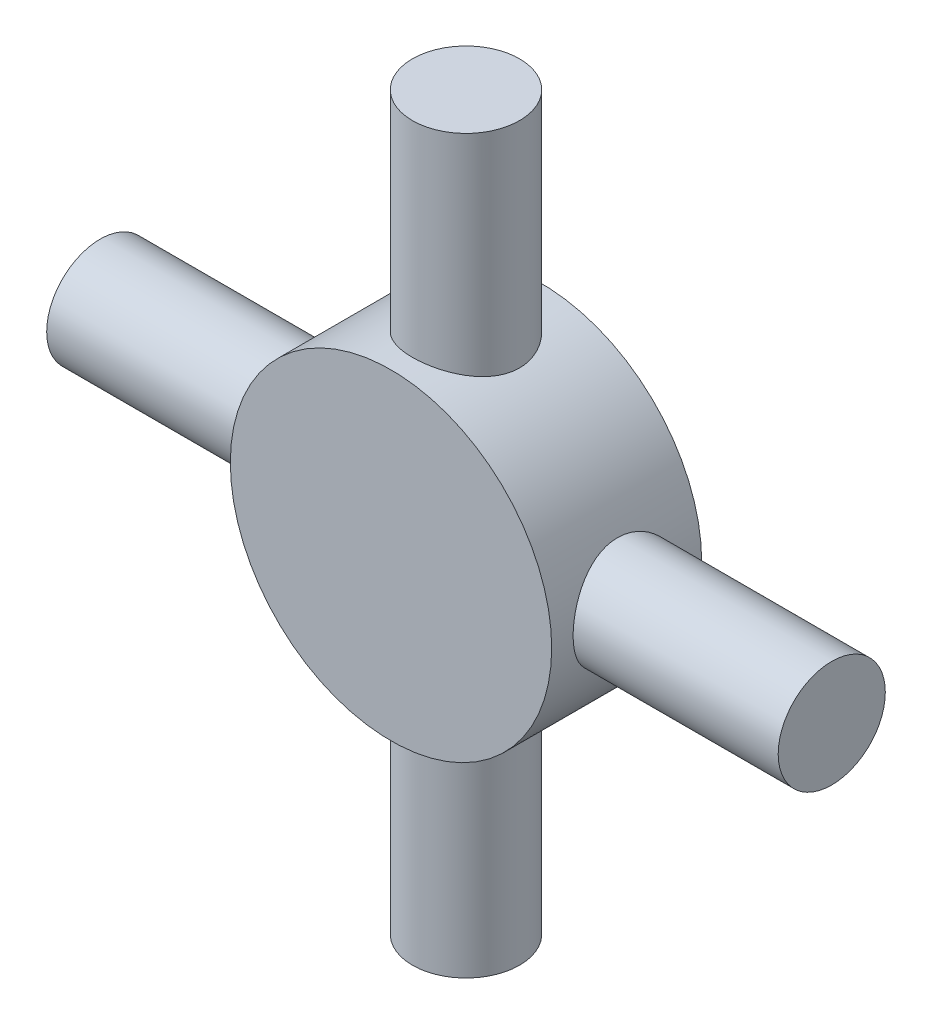
ISO-10303-21;
HEADER;
FILE_DESCRIPTION(('STEP AP214'),'2;1');
FILE_NAME('part.step','',(''),(''),'','','');
FILE_SCHEMA(('AUTOMOTIVE_DESIGN { 1 0 10303 214 1 1 1 1 }'));
ENDSEC;
DATA;
#1=APPLICATION_CONTEXT('core data for automotive mechanical design processes');
#2=APPLICATION_PROTOCOL_DEFINITION('international standard','automotive_design',2000,#1);
#3=PRODUCT_CONTEXT('',#1,'mechanical');
#4=PRODUCT('Part','Part','',(#3));
#5=PRODUCT_RELATED_PRODUCT_CATEGORY('part','',(#4));
#6=PRODUCT_DEFINITION_FORMATION('','',#4);
#7=PRODUCT_DEFINITION_CONTEXT('part definition',#1,'design');
#8=PRODUCT_DEFINITION('design','',#6,#7);
#9=PRODUCT_DEFINITION_SHAPE('','',#8);
#10=(LENGTH_UNIT() NAMED_UNIT(*) SI_UNIT(.MILLI.,.METRE.));
#11=(NAMED_UNIT(*) PLANE_ANGLE_UNIT() SI_UNIT($,.RADIAN.));
#12=(NAMED_UNIT(*) SI_UNIT($,.STERADIAN.) SOLID_ANGLE_UNIT());
#13=UNCERTAINTY_MEASURE_WITH_UNIT(LENGTH_MEASURE(1.E-05),#10,'distance_accuracy_value','');
#14=(GEOMETRIC_REPRESENTATION_CONTEXT(3) GLOBAL_UNCERTAINTY_ASSIGNED_CONTEXT((#13)) GLOBAL_UNIT_ASSIGNED_CONTEXT((#10,
#11,#12)) REPRESENTATION_CONTEXT('',''));
#15=CARTESIAN_POINT('',(0.,0.,0.));
#16=DIRECTION('',(0.,0.,1.));
#17=DIRECTION('',(1.,0.,0.));
#18=AXIS2_PLACEMENT_3D('',#15,#16,#17);
#19=CARTESIAN_POINT('',(0.,0.,5.));
#20=DIRECTION('',(0.,0.,-1.));
#21=DIRECTION('',(-1.,0.,0.));
#22=AXIS2_PLACEMENT_3D('',#19,#20,#21);
#23=CYLINDRICAL_SURFACE('',#22,7.5);
#24=CARTESIAN_POINT('',(7.5,0.,0.));
#25=CARTESIAN_POINT('',(7.5000003825236,0.136408407216808,-6.34329101924872E-07));
#26=CARTESIAN_POINT('',(7.49624423768862,0.272812986346375,0.0112006653180414));
#27=CARTESIAN_POINT('',(7.48163025508202,0.54160440218243,0.0555727720430464));
#28=CARTESIAN_POINT('',(7.47077168005381,0.673990820297044,0.0887458598723056));
#29=CARTESIAN_POINT('',(7.44313269766107,0.93083197375444,0.175798108460121));
#30=CARTESIAN_POINT('',(7.42636219327133,1.05529956471509,0.229642656148179));
#31=CARTESIAN_POINT('',(7.38861114293355,1.29343734201331,0.356352932095868));
#32=CARTESIAN_POINT('',(7.36762976669445,1.40710539239676,0.429222412506503));
#33=CARTESIAN_POINT('',(7.32285236107513,1.62435418755567,0.594564512146881));
#34=CARTESIAN_POINT('',(7.29898891159462,1.72750925074577,0.687578085651233));
#35=CARTESIAN_POINT('',(7.25150786957804,1.91708173175521,0.889417886766415));
#36=CARTESIAN_POINT('',(7.22789033226373,2.00349546372366,0.998247587321281));
#37=CARTESIAN_POINT('',(7.18283331193184,2.15956235556965,1.23246278799115));
#38=CARTESIAN_POINT('',(7.1614759818922,2.22866214555258,1.35823434933031));
#39=CARTESIAN_POINT('',(7.12438263546503,2.3445471846943,1.62044023614637));
#40=CARTESIAN_POINT('',(7.10864490401864,2.39133924346691,1.75687129290686));
#41=CARTESIAN_POINT('',(7.08528258173443,2.45968365377291,2.03168305374178));
#42=CARTESIAN_POINT('',(7.07740239424028,2.48203362067942,2.16984302122266));
#43=CARTESIAN_POINT('',(7.06989141573769,2.50335280833619,2.4481593853897));
#44=CARTESIAN_POINT('',(7.07025807556825,2.5023292540118,2.58831515177298));
#45=CARTESIAN_POINT('',(7.0789753752045,2.47754975925855,2.85984157611005));
#46=CARTESIAN_POINT('',(7.08696039668832,2.45483478291749,2.99132100729755));
#47=CARTESIAN_POINT('',(7.10941644311377,2.38901540712354,3.24848354901709));
#48=CARTESIAN_POINT('',(7.12388824460269,2.34590856647968,3.37416596358768));
#49=CARTESIAN_POINT('',(7.15794777828122,2.23984764515053,3.6185318739787));
#50=CARTESIAN_POINT('',(7.17761414482793,2.17658512176816,3.73707006367381));
#51=CARTESIAN_POINT('',(7.21981396439316,2.03222276575785,3.96217727069932));
#52=CARTESIAN_POINT('',(7.24234824476159,1.95111778091001,4.06874281733345));
#53=CARTESIAN_POINT('',(7.28918322919352,1.76837333170559,4.27272899540193));
#54=CARTESIAN_POINT('',(7.31351473387107,1.66588287519078,4.36938173627267));
#55=CARTESIAN_POINT('',(7.36017345967592,1.44584892492516,4.54432816665849));
#56=CARTESIAN_POINT('',(7.38250048845169,1.32830398915204,4.62262009541124));
#57=CARTESIAN_POINT('',(7.42292769844484,1.07986903261567,4.75924075058767));
#58=CARTESIAN_POINT('',(7.44098375020098,0.948858191040842,4.81736372835183));
#59=CARTESIAN_POINT('',(7.47051417861087,0.678172708411269,4.91050793488928));
#60=CARTESIAN_POINT('',(7.48199084137198,0.538501095387384,4.94553718855859));
#61=CARTESIAN_POINT('',(7.49669067678601,0.260959573823261,4.9901391650559));
#62=CARTESIAN_POINT('',(7.5002500458432,0.123273999662116,5.00074952293188));
#63=CARTESIAN_POINT('',(7.49972256737069,-0.151937674900592,4.99916831600383));
#64=CARTESIAN_POINT('',(7.49563701048406,-0.289463798299125,4.98698060005031));
#65=CARTESIAN_POINT('',(7.48050061792761,-0.556299665760639,4.9409702306601));
#66=CARTESIAN_POINT('',(7.46965496777981,-0.685732017087108,4.90778448487626));
#67=CARTESIAN_POINT('',(7.44229617075175,-0.937139896448934,4.82151638883318));
#68=CARTESIAN_POINT('',(7.42578230116688,-1.05911447127152,4.76843150133054));
#69=CARTESIAN_POINT('',(7.38822328218224,-1.29572074098318,4.64232392039804));
#70=CARTESIAN_POINT('',(7.36707036889465,-1.41007489804287,4.56881351679207));
#71=CARTESIAN_POINT('',(7.32263134790656,-1.62516207533897,4.40451462496629));
#72=CARTESIAN_POINT('',(7.29934458984569,-1.72589091948894,4.31372085992059));
#73=CARTESIAN_POINT('',(7.25192119951112,-1.91563126951575,4.11255312248353));
#74=CARTESIAN_POINT('',(7.2277940271857,-2.00390242311443,4.00147693268285));
#75=CARTESIAN_POINT('',(7.18249933236772,-2.16064380580894,3.76557108047278));
#76=CARTESIAN_POINT('',(7.16133183455006,-2.22911386982753,3.64074130341481));
#77=CARTESIAN_POINT('',(7.12455979478459,-2.3439923260409,3.38081746177526));
#78=CARTESIAN_POINT('',(7.10894401982447,-2.39044533041255,3.24574480207809));
#79=CARTESIAN_POINT('',(7.08527080766124,-2.45973666689839,2.96905337488967));
#80=CARTESIAN_POINT('',(7.07720996559098,-2.48258563738485,2.82743758648913));
#81=CARTESIAN_POINT('',(7.06994647185443,-2.50319070619336,2.54950725989771));
#82=CARTESIAN_POINT('',(7.07031000643538,-2.502175643271,2.41329414928294));
#83=CARTESIAN_POINT('',(7.07878174559668,-2.47810573362173,2.14308731269485));
#84=CARTESIAN_POINT('',(7.08688948923404,-2.45505219864646,2.00909345511228));
#85=CARTESIAN_POINT('',(7.10961310762229,-2.38842953282336,1.74966084249382));
#86=CARTESIAN_POINT('',(7.12410245056194,-2.34525836503879,1.62410793748876));
#87=CARTESIAN_POINT('',(7.15790997046171,-2.23994841439937,1.38193148265433));
#88=CARTESIAN_POINT('',(7.17722921908483,-2.17780542138451,1.26530992202998));
#89=CARTESIAN_POINT('',(7.21957073065116,-2.03315173145858,1.03879082519272));
#90=CARTESIAN_POINT('',(7.24271779105343,-1.94987060691145,0.929408745254036));
#91=CARTESIAN_POINT('',(7.28958390708132,-1.76660720783912,0.7257754665395));
#92=CARTESIAN_POINT('',(7.31330312280931,-1.66662021112871,0.631528560779813));
#93=CARTESIAN_POINT('',(7.3597507631386,-1.44810389230172,0.457138969277055));
#94=CARTESIAN_POINT('',(7.38240454503142,-1.32900378374932,0.377689130622501));
#95=CARTESIAN_POINT('',(7.4231497793153,-1.07839339351656,0.240023927873383));
#96=CARTESIAN_POINT('',(7.44124239769824,-0.946886295330873,0.181803135194894));
#97=CARTESIAN_POINT('',(7.47013787671355,-0.681234118002441,0.0906959187783202));
#98=CARTESIAN_POINT('',(7.48123031056307,-0.547469394191022,0.056793834341559));
#99=CARTESIAN_POINT('',(7.49616017660555,-0.275801040025618,0.011449298307184));
#100=CARTESIAN_POINT('',(7.49999961329762,-0.137898563921866,6.41258657549568E-07));
#101=CARTESIAN_POINT('',(7.5,0.,0.));
#102=B_SPLINE_CURVE_WITH_KNOTS('',3,(#24,#25,#26,#27,#28,#29,#30,#31,#32,#33,#34,#35,#36,#37,
#38,#39,#40,#41,#42,#43,#44,#45,#46,#47,#48,#49,#50,#51,#52,#53,#54,#55,#56,#57,#58,#59,#60,#61,
#62,#63,#64,#65,#66,#67,#68,#69,#70,#71,#72,#73,#74,#75,#76,#77,#78,#79,#80,#81,#82,#83,#84,#85,
#86,#87,#88,#89,#90,#91,#92,#93,#94,#95,#96,#97,#98,#99,#100,#101),.UNSPECIFIED.,.T.,.F.,(4,2,2,
2,2,2,2,2,2,2,2,2,2,2,2,2,2,2,2,2,2,2,2,2,2,2,2,2,2,2,2,2,2,2,2,2,2,2,4),(0.,0.408717765065027,
0.817477963168802,1.22555668217568,1.63371594449775,2.0546171070689,2.47561083218826,
2.90870962058676,3.34167611732083,3.760048143546,4.17829084968714,4.57742066378201,
4.97659827138705,5.38220427887827,5.78792756395518,6.21483264528417,6.64177864916546,
7.07296014125894,7.50399172193021,7.91633957937924,8.32861782910441,8.72895394945534,
9.1293411321026,9.54025999609341,9.95130452054728,10.3810255720188,10.8107502058749,
11.2396003456693,11.668257117646,12.0748916516065,12.4815019837844,12.8803896770104,
13.2793659543994,13.6957516672951,14.1122552780945,14.5449915208775,14.9776170288114,
15.3909139593453,15.8040966509535),.UNSPECIFIED.);
#103=CARTESIAN_POINT('',(7.5,0.,0.));
#104=VERTEX_POINT('',#103);
#105=EDGE_CURVE('E125',#104,#104,#102,.T.);
#106=ORIENTED_EDGE('',*,*,#105,.F.);
#107=EDGE_LOOP('',(#106));
#108=FACE_BOUND('',#107,.T.);
#109=CARTESIAN_POINT('',(2.49999999999993,-7.0710678118655,2.5));
#110=CARTESIAN_POINT('',(2.50000064486921,-7.07106736326088,2.63617043709018));
#111=CARTESIAN_POINT('',(2.48883695921373,-7.07504423227146,2.77233699955898));
#112=CARTESIAN_POINT('',(2.44462782922195,-7.0904393520314,3.04063605248562));
#113=CARTESIAN_POINT('',(2.41157878042092,-7.10185882855474,3.17276787468117));
#114=CARTESIAN_POINT('',(2.32488871421219,-7.13070509221981,3.42906723249322));
#115=CARTESIAN_POINT('',(2.27128805350804,-7.14812009928307,3.55324982360679));
#116=CARTESIAN_POINT('',(2.14515407110338,-7.18697805025814,3.7909001213699));
#117=CARTESIAN_POINT('',(2.07261657215038,-7.20842188259033,3.90436545638408));
#118=CARTESIAN_POINT('',(1.90762786610712,-7.25386223518685,4.12179990584578));
#119=CARTESIAN_POINT('',(1.81456085344472,-7.27792237111612,4.22528857167932));
#120=CARTESIAN_POINT('',(1.61246916803591,-7.32534662002509,4.4155170030616));
#121=CARTESIAN_POINT('',(1.50344193763086,-7.34871062072406,4.50225407895593));
#122=CARTESIAN_POINT('',(1.26901126991245,-7.39284667304499,4.65869724332398));
#123=CARTESIAN_POINT('',(1.14325477806124,-7.41353519254015,4.72789992654489));
#124=CARTESIAN_POINT('',(0.881078057468607,-7.44923966927458,4.84397896281877));
#125=CARTESIAN_POINT('',(0.744660714217952,-7.46425715507506,4.89086133294226));
#126=CARTESIAN_POINT('',(0.470072043583658,-7.48647688579767,4.95933963658098));
#127=CARTESIAN_POINT('',(0.332126887132343,-7.49393286943898,4.98175861564252));
#128=CARTESIAN_POINT('',(0.0542446870601454,-7.5010902054562,5.00329073340165));
#129=CARTESIAN_POINT('',(-0.0856918338598193,-7.50079355657239,5.00240987913103));
#130=CARTESIAN_POINT('',(-0.357758787984615,-7.49265099046828,4.97788936358493));
#131=CARTESIAN_POINT('',(-0.489980121479219,-7.48510161887793,4.95514367881378));
#132=CARTESIAN_POINT('',(-0.748608597055507,-7.46367418349328,4.88901754754882));
#133=CARTESIAN_POINT('',(-0.875015344448118,-7.44979569077954,4.84563570255044));
#134=CARTESIAN_POINT('',(-1.12038118710501,-7.4168917573306,4.73894670673485));
#135=CARTESIAN_POINT('',(-1.23922055242219,-7.39780106310038,4.67538515363372));
#136=CARTESIAN_POINT('',(-1.46481081381838,-7.35645982597296,4.53035073637836));
#137=CARTESIAN_POINT('',(-1.57155833596343,-7.33420840503665,4.44887289168093));
#138=CARTESIAN_POINT('',(-1.77525216637835,-7.2876547962474,4.26581401635075));
#139=CARTESIAN_POINT('',(-1.87150039266326,-7.26330537922192,4.1634671053963));
#140=CARTESIAN_POINT('',(-2.04569314899551,-7.21618338122249,3.94387818568345));
#141=CARTESIAN_POINT('',(-2.12363485820393,-7.19341104364036,3.82663388567989));
#142=CARTESIAN_POINT('',(-2.25996863758943,-7.15176312802778,3.5783659359914));
#143=CARTESIAN_POINT('',(-2.31806615905343,-7.13294773211867,3.44716967170557));
#144=CARTESIAN_POINT('',(-2.41110798317342,-7.10204127060959,3.17607151446396));
#145=CARTESIAN_POINT('',(-2.44606198936881,-7.08994738717729,3.03617329698439));
#146=CARTESIAN_POINT('',(-2.49040320524388,-7.0744909078896,2.75840411147106));
#147=CARTESIAN_POINT('',(-2.50087273876916,-7.07075900796887,2.62072643812836));
#148=CARTESIAN_POINT('',(-2.49901359727437,-7.07141680147958,2.34555962721473));
#149=CARTESIAN_POINT('',(-2.48668906306698,-7.07580501979534,2.20807045994003));
#150=CARTESIAN_POINT('',(-2.44056412888085,-7.09184045225746,1.94210758572023));
#151=CARTESIAN_POINT('',(-2.40751598495178,-7.10323313602098,1.8134864246229));
#152=CARTESIAN_POINT('',(-2.32178465640124,-7.13171384177555,1.56364098440204));
#153=CARTESIAN_POINT('',(-2.26909799090863,-7.14880287337096,1.44241802102305));
#154=CARTESIAN_POINT('',(-2.14368585184742,-7.18742193989465,1.2065489478825));
#155=CARTESIAN_POINT('',(-2.07037779589632,-7.20907564164069,1.0922333933955));
#156=CARTESIAN_POINT('',(-1.90646407639397,-7.25414421827411,0.877134869040703));
#157=CARTESIAN_POINT('',(-1.81585331374703,-7.27755961109484,0.776355903346952));
#158=CARTESIAN_POINT('',(-1.61472926475089,-7.32487596594621,0.586180039773404));
#159=CARTESIAN_POINT('',(-1.50346817636671,-7.3487460894474,0.497564024952876));
#160=CARTESIAN_POINT('',(-1.26706822850072,-7.3931712903277,0.340209644129893));
#161=CARTESIAN_POINT('',(-1.14192986216146,-7.41372648544236,0.271470572093939));
#162=CARTESIAN_POINT('',(-0.881949656080818,-7.44911014526506,0.156449737845712));
#163=CARTESIAN_POINT('',(-0.74717780830307,-7.46397575011327,0.110021807129836));
#164=CARTESIAN_POINT('',(-0.47114616461512,-7.48646527094436,0.0406806448497384));
#165=CARTESIAN_POINT('',(-0.329888729884803,-7.49409180085047,0.0177589252987432));
#166=CARTESIAN_POINT('',(-0.0520383396501818,-7.50104658090641,-0.00315519401410612));
#167=CARTESIAN_POINT('',(0.0844618097999666,-7.50074800223598,-0.00226863483094353));
#168=CARTESIAN_POINT('',(0.355277862500355,-7.49280491298495,0.0216432703660212));
#169=CARTESIAN_POINT('',(0.489593942047563,-7.4851609983394,0.0446668203819221));
#170=CARTESIAN_POINT('',(0.750105298580069,-7.46352287386032,0.111455586439906));
#171=CARTESIAN_POINT('',(0.876395677281895,-7.44963145902872,0.154885538382332));
#172=CARTESIAN_POINT('',(1.11994587734941,-7.41692901761239,0.260943827742888));
#173=CARTESIAN_POINT('',(1.237204060356,-7.39811710120042,0.323575637992532));
#174=CARTESIAN_POINT('',(1.46408504077189,-7.35664672069704,0.468923780255018));
#175=CARTESIAN_POINT('',(1.57326562889394,-7.33387181229818,0.5522967134541));
#176=CARTESIAN_POINT('',(1.77645256568099,-7.28732471979701,0.735643477890485));
#177=CARTESIAN_POINT('',(1.8704540540614,-7.26355221932745,0.835622605656818));
#178=CARTESIAN_POINT('',(2.04435452208272,-7.21658199563998,1.05402338896737));
#179=CARTESIAN_POINT('',(2.12355741499468,-7.19344319971579,1.1730137774416));
#180=CARTESIAN_POINT('',(2.26078585825271,-7.15150483307541,1.42333606725695));
#181=CARTESIAN_POINT('',(2.31881694204861,-7.13270412903126,1.55466473257416));
#182=CARTESIAN_POINT('',(2.40960957051034,-7.10253335516289,1.81990456003908));
#183=CARTESIAN_POINT('',(2.44339477287372,-7.09086582142958,1.95343065881341));
#184=CARTESIAN_POINT('',(2.48858580037309,-7.07513458848798,2.22464012616675));
#185=CARTESIAN_POINT('',(2.49999934799141,-7.07106826543656,2.36232204352677));
#186=CARTESIAN_POINT('',(2.49999999999993,-7.0710678118655,2.5));
#187=B_SPLINE_CURVE_WITH_KNOTS('',3,(#109,#110,#111,#112,#113,#114,#115,#116,#117,#118,#119,
#120,#121,#122,#123,#124,#125,#126,#127,#128,#129,#130,#131,#132,#133,#134,#135,#136,#137,#138,
#139,#140,#141,#142,#143,#144,#145,#146,#147,#148,#149,#150,#151,#152,#153,#154,#155,#156,#157,
#158,#159,#160,#161,#162,#163,#164,#165,#166,#167,#168,#169,#170,#171,#172,#173,#174,#175,#176,
#177,#178,#179,#180,#181,#182,#183,#184,#185,#186),.UNSPECIFIED.,.T.,.F.,(4,2,2,2,2,2,2,2,2,2,2,
2,2,2,2,2,2,2,2,2,2,2,2,2,2,2,2,2,2,2,2,2,2,2,2,2,2,2,4),(0.,0.40800146199839,0.816070137537909,
1.22334156875207,1.63070291546361,2.0525334356892,2.4744316292997,2.90733765359143,
3.34012690966973,3.75785796912336,4.17548133255818,4.57672512063922,4.97799610473092,
5.38454137150837,5.79119979685055,6.21700435909794,6.64287449030265,7.07481599607639,
7.50657628391539,7.91885728411099,8.33106339593085,8.7291098942194,9.12722697867365,
9.53797144339287,9.94883714155319,10.3794702042773,10.8100879689383,11.2378447797713,
11.6654470751039,12.0729521169409,12.4804241002445,12.8814239010107,13.2824962690811,
13.6983879880158,14.1144126108158,14.5467225684036,14.9789194566717,15.3915803040673,
15.8040986797616),.UNSPECIFIED.);
#188=CARTESIAN_POINT('',(2.49999999999993,-7.0710678118655,2.5));
#189=VERTEX_POINT('',#188);
#190=EDGE_CURVE('E118',#189,#189,#187,.T.);
#191=ORIENTED_EDGE('',*,*,#190,.F.);
#192=EDGE_LOOP('',(#191));
#193=FACE_BOUND('',#192,.T.);
#194=CARTESIAN_POINT('',(-7.5,0.,5.));
#195=CARTESIAN_POINT('',(-7.5000003825236,0.136408407216808,5.0000006343291));
#196=CARTESIAN_POINT('',(-7.49624423768862,0.272812986346375,4.98879933468196));
#197=CARTESIAN_POINT('',(-7.48163025508202,0.541604402182431,4.94442722795695));
#198=CARTESIAN_POINT('',(-7.47077168005381,0.673990820297045,4.91125414012769));
#199=CARTESIAN_POINT('',(-7.44313269766107,0.93083197375444,4.82420189153988));
#200=CARTESIAN_POINT('',(-7.42636219327133,1.05529956471509,4.77035734385182));
#201=CARTESIAN_POINT('',(-7.38861114293355,1.29343734201331,4.64364706790413));
#202=CARTESIAN_POINT('',(-7.36762976669445,1.40710539239676,4.5707775874935));
#203=CARTESIAN_POINT('',(-7.32285236107513,1.62435418755567,4.40543548785312));
#204=CARTESIAN_POINT('',(-7.29898891159462,1.72750925074577,4.31242191434877));
#205=CARTESIAN_POINT('',(-7.25150786957804,1.91708173175521,4.11058211323358));
#206=CARTESIAN_POINT('',(-7.22789033226373,2.00349546372366,4.00175241267872));
#207=CARTESIAN_POINT('',(-7.18283331193184,2.15956235556965,3.76753721200885));
#208=CARTESIAN_POINT('',(-7.1614759818922,2.22866214555258,3.64176565066969));
#209=CARTESIAN_POINT('',(-7.12438263546503,2.3445471846943,3.37955976385363));
#210=CARTESIAN_POINT('',(-7.10864490401864,2.39133924346691,3.24312870709314));
#211=CARTESIAN_POINT('',(-7.08528258173443,2.45968365377291,2.96831694625822));
#212=CARTESIAN_POINT('',(-7.07740239424028,2.48203362067942,2.83015697877734));
#213=CARTESIAN_POINT('',(-7.06989141573769,2.50335280833619,2.5518406146103));
#214=CARTESIAN_POINT('',(-7.07025807556825,2.5023292540118,2.41168484822702));
#215=CARTESIAN_POINT('',(-7.0789753752045,2.47754975925855,2.14015842388995));
#216=CARTESIAN_POINT('',(-7.08696039668832,2.45483478291749,2.00867899270245));
#217=CARTESIAN_POINT('',(-7.10941644311377,2.38901540712354,1.75151645098291));
#218=CARTESIAN_POINT('',(-7.12388824460269,2.34590856647968,1.62583403641232));
#219=CARTESIAN_POINT('',(-7.15794777828122,2.23984764515053,1.3814681260213));
#220=CARTESIAN_POINT('',(-7.17761414482793,2.17658512176816,1.26292993632618));
#221=CARTESIAN_POINT('',(-7.21981396439316,2.03222276575785,1.03782272930068));
#222=CARTESIAN_POINT('',(-7.24234824476159,1.95111778091001,0.931257182666546));
#223=CARTESIAN_POINT('',(-7.28918322919352,1.76837333170559,0.727271004598068));
#224=CARTESIAN_POINT('',(-7.31351473387107,1.66588287519078,0.630618263727325));
#225=CARTESIAN_POINT('',(-7.36017345967592,1.44584892492516,0.455671833341505));
#226=CARTESIAN_POINT('',(-7.38250048845169,1.32830398915204,0.37737990458876));
#227=CARTESIAN_POINT('',(-7.42292769844484,1.07986903261567,0.240759249412328));
#228=CARTESIAN_POINT('',(-7.44098375020098,0.948858191040841,0.18263627164817));
#229=CARTESIAN_POINT('',(-7.47051417861087,0.678172708411269,0.0894920651107221));
#230=CARTESIAN_POINT('',(-7.48199084137198,0.538501095387384,0.0544628114414053));
#231=CARTESIAN_POINT('',(-7.49669067678601,0.26095957382326,0.00986083494410218));
#232=CARTESIAN_POINT('',(-7.5002500458432,0.123273999662115,-0.000749522931878178));
#233=CARTESIAN_POINT('',(-7.49972256737069,-0.151937674900594,0.000831683996171473));
#234=CARTESIAN_POINT('',(-7.49563701048406,-0.289463798299126,0.0130193999496905));
#235=CARTESIAN_POINT('',(-7.48050061792761,-0.556299665760639,0.0590297693398969));
#236=CARTESIAN_POINT('',(-7.46965496777981,-0.685732017087109,0.0922155151237355));
#237=CARTESIAN_POINT('',(-7.44229617075175,-0.937139896448934,0.178483611166821));
#238=CARTESIAN_POINT('',(-7.42578230116688,-1.05911447127152,0.231568498669464));
#239=CARTESIAN_POINT('',(-7.38822328218224,-1.29572074098318,0.357676079601965));
#240=CARTESIAN_POINT('',(-7.36707036889465,-1.41007489804287,0.431186483207927));
#241=CARTESIAN_POINT('',(-7.32263134790656,-1.62516207533897,0.595485375033708));
#242=CARTESIAN_POINT('',(-7.29934458984569,-1.72589091948894,0.686279140079413));
#243=CARTESIAN_POINT('',(-7.25192119951112,-1.91563126951575,0.887446877516471));
#244=CARTESIAN_POINT('',(-7.2277940271857,-2.00390242311443,0.998523067317152));
#245=CARTESIAN_POINT('',(-7.18249933236772,-2.16064380580894,1.23442891952722));
#246=CARTESIAN_POINT('',(-7.16133183455006,-2.22911386982753,1.35925869658519));
#247=CARTESIAN_POINT('',(-7.12455979478459,-2.3439923260409,1.61918253822474));
#248=CARTESIAN_POINT('',(-7.10894401982447,-2.39044533041255,1.75425519792191));
#249=CARTESIAN_POINT('',(-7.08527080766124,-2.45973666689839,2.03094662511033));
#250=CARTESIAN_POINT('',(-7.07720996559098,-2.48258563738485,2.17256241351087));
#251=CARTESIAN_POINT('',(-7.06994647185443,-2.50319070619336,2.45049274010229));
#252=CARTESIAN_POINT('',(-7.07031000643538,-2.502175643271,2.58670585071706));
#253=CARTESIAN_POINT('',(-7.07878174559668,-2.47810573362173,2.85691268730516));
#254=CARTESIAN_POINT('',(-7.08688948923404,-2.45505219864646,2.99090654488772));
#255=CARTESIAN_POINT('',(-7.10961310762229,-2.38842953282336,3.25033915750618));
#256=CARTESIAN_POINT('',(-7.12410245056194,-2.34525836503879,3.37589206251124));
#257=CARTESIAN_POINT('',(-7.15790997046171,-2.23994841439937,3.61806851734567));
#258=CARTESIAN_POINT('',(-7.17722921908483,-2.17780542138451,3.73469007797002));
#259=CARTESIAN_POINT('',(-7.21957073065116,-2.03315173145857,3.96120917480728));
#260=CARTESIAN_POINT('',(-7.24271779105343,-1.94987060691145,4.07059125474597));
#261=CARTESIAN_POINT('',(-7.28958390708132,-1.76660720783912,4.2742245334605));
#262=CARTESIAN_POINT('',(-7.31330312280931,-1.6666202111287,4.36847143922019));
#263=CARTESIAN_POINT('',(-7.3597507631386,-1.44810389230172,4.54286103072295));
#264=CARTESIAN_POINT('',(-7.38240454503142,-1.32900378374932,4.6223108693775));
#265=CARTESIAN_POINT('',(-7.4231497793153,-1.07839339351656,4.75997607212662));
#266=CARTESIAN_POINT('',(-7.44124239769824,-0.946886295330872,4.81819686480511));
#267=CARTESIAN_POINT('',(-7.47013787671355,-0.68123411800244,4.90930408122168));
#268=CARTESIAN_POINT('',(-7.48123031056307,-0.547469394191022,4.94320616565844));
#269=CARTESIAN_POINT('',(-7.49616017660555,-0.275801040025617,4.98855070169282));
#270=CARTESIAN_POINT('',(-7.49999961329762,-0.137898563921866,4.99999935874134));
#271=CARTESIAN_POINT('',(-7.5,0.,5.));
#272=B_SPLINE_CURVE_WITH_KNOTS('',3,(#194,#195,#196,#197,#198,#199,#200,#201,#202,#203,#204,
#205,#206,#207,#208,#209,#210,#211,#212,#213,#214,#215,#216,#217,#218,#219,#220,#221,#222,#223,
#224,#225,#226,#227,#228,#229,#230,#231,#232,#233,#234,#235,#236,#237,#238,#239,#240,#241,#242,
#243,#244,#245,#246,#247,#248,#249,#250,#251,#252,#253,#254,#255,#256,#257,#258,#259,#260,#261,
#262,#263,#264,#265,#266,#267,#268,#269,#270,#271),.UNSPECIFIED.,.T.,.F.,(4,2,2,2,2,2,2,2,2,2,2,
2,2,2,2,2,2,2,2,2,2,2,2,2,2,2,2,2,2,2,2,2,2,2,2,2,2,2,4),(0.,0.408717765065028,
0.817477963168802,1.22555668217568,1.63371594449775,2.0546171070689,2.47561083218826,
2.90870962058676,3.34167611732083,3.760048143546,4.17829084968714,4.57742066378201,
4.97659827138705,5.38220427887827,5.78792756395518,6.21483264528418,6.64177864916546,
7.07296014125894,7.50399172193021,7.91633957937924,8.32861782910442,8.72895394945534,
9.1293411321026,9.54025999609342,9.95130452054728,10.3810255720188,10.8107502058749,
11.2396003456693,11.668257117646,12.0748916516065,12.4815019837844,12.8803896770104,
13.2793659543994,13.6957516672951,14.1122552780945,14.5449915208775,14.9776170288114,
15.3909139593453,15.8040966509535),.UNSPECIFIED.);
#273=CARTESIAN_POINT('',(-7.5,0.,5.));
#274=VERTEX_POINT('',#273);
#275=EDGE_CURVE('E11',#274,#274,#272,.T.);
#276=ORIENTED_EDGE('',*,*,#275,.F.);
#277=EDGE_LOOP('',(#276));
#278=FACE_BOUND('',#277,.T.);
#279=CARTESIAN_POINT('',(-2.49999999999998,7.07106781186549,2.5));
#280=CARTESIAN_POINT('',(-2.50000064486926,7.07106736326086,2.63617043709018));
#281=CARTESIAN_POINT('',(-2.48883695921378,7.07504423227144,2.77233699955898));
#282=CARTESIAN_POINT('',(-2.444627829222,7.09043935203138,3.04063605248562));
#283=CARTESIAN_POINT('',(-2.41157878042097,7.10185882855473,3.17276787468117));
#284=CARTESIAN_POINT('',(-2.32488871421224,7.1307050922198,3.42906723249322));
#285=CARTESIAN_POINT('',(-2.27128805350809,7.14812009928305,3.55324982360679));
#286=CARTESIAN_POINT('',(-2.14515407110343,7.18697805025812,3.7909001213699));
#287=CARTESIAN_POINT('',(-2.07261657215043,7.20842188259032,3.90436545638408));
#288=CARTESIAN_POINT('',(-1.90762786610717,7.25386223518684,4.12179990584578));
#289=CARTESIAN_POINT('',(-1.81456085344477,7.27792237111611,4.22528857167932));
#290=CARTESIAN_POINT('',(-1.61246916803596,7.32534662002508,4.4155170030616));
#291=CARTESIAN_POINT('',(-1.50344193763091,7.34871062072405,4.50225407895593));
#292=CARTESIAN_POINT('',(-1.2690112699125,7.39284667304498,4.65869724332398));
#293=CARTESIAN_POINT('',(-1.14325477806129,7.41353519254014,4.72789992654489));
#294=CARTESIAN_POINT('',(-0.881078057468658,7.44923966927458,4.84397896281878));
#295=CARTESIAN_POINT('',(-0.744660714218003,7.46425715507505,4.89086133294227));
#296=CARTESIAN_POINT('',(-0.470072043583709,7.48647688579767,4.95933963658098));
#297=CARTESIAN_POINT('',(-0.332126887132394,7.49393286943898,4.98175861564252));
#298=CARTESIAN_POINT('',(-0.0542446870601965,7.5010902054562,5.00329073340165));
#299=CARTESIAN_POINT('',(0.0856918338597682,7.50079355657239,5.00240987913103));
#300=CARTESIAN_POINT('',(0.357758787984564,7.49265099046828,4.97788936358493));
#301=CARTESIAN_POINT('',(0.489980121479169,7.48510161887793,4.95514367881378));
#302=CARTESIAN_POINT('',(0.748608597055456,7.46367418349329,4.88901754754882));
#303=CARTESIAN_POINT('',(0.875015344448067,7.44979569077954,4.84563570255044));
#304=CARTESIAN_POINT('',(1.12038118710496,7.4168917573306,4.73894670673485));
#305=CARTESIAN_POINT('',(1.23922055242214,7.39780106310038,4.67538515363372));
#306=CARTESIAN_POINT('',(1.46481081381833,7.35645982597297,4.53035073637836));
#307=CARTESIAN_POINT('',(1.57155833596338,7.33420840503666,4.44887289168092));
#308=CARTESIAN_POINT('',(1.7752521663783,7.28765479624741,4.26581401635075));
#309=CARTESIAN_POINT('',(1.87150039266321,7.26330537922194,4.1634671053963));
#310=CARTESIAN_POINT('',(2.04569314899546,7.21618338122251,3.94387818568345));
#311=CARTESIAN_POINT('',(2.12363485820388,7.19341104364038,3.82663388567989));
#312=CARTESIAN_POINT('',(2.25996863758938,7.1517631280278,3.5783659359914));
#313=CARTESIAN_POINT('',(2.31806615905338,7.13294773211869,3.44716967170556));
#314=CARTESIAN_POINT('',(2.41110798317337,7.10204127060961,3.17607151446395));
#315=CARTESIAN_POINT('',(2.44606198936876,7.08994738717731,3.03617329698438));
#316=CARTESIAN_POINT('',(2.49040320524383,7.07449090788962,2.75840411147106));
#317=CARTESIAN_POINT('',(2.50087273876911,7.07075900796889,2.62072643812836));
#318=CARTESIAN_POINT('',(2.49901359727432,7.0714168014796,2.34555962721473));
#319=CARTESIAN_POINT('',(2.48668906306693,7.07580501979535,2.20807045994003));
#320=CARTESIAN_POINT('',(2.4405641288808,7.09184045225748,1.94210758572023));
#321=CARTESIAN_POINT('',(2.40751598495173,7.103233136021,1.8134864246229));
#322=CARTESIAN_POINT('',(2.32178465640119,7.13171384177557,1.56364098440204));
#323=CARTESIAN_POINT('',(2.26909799090858,7.14880287337098,1.44241802102305));
#324=CARTESIAN_POINT('',(2.14368585184737,7.18742193989467,1.2065489478825));
#325=CARTESIAN_POINT('',(2.07037779589627,7.2090756416407,1.09223339339549));
#326=CARTESIAN_POINT('',(1.90646407639392,7.25414421827412,0.877134869040701));
#327=CARTESIAN_POINT('',(1.81585331374698,7.27755961109485,0.776355903346951));
#328=CARTESIAN_POINT('',(1.61472926475084,7.32487596594622,0.586180039773403));
#329=CARTESIAN_POINT('',(1.50346817636666,7.34874608944741,0.497564024952875));
#330=CARTESIAN_POINT('',(1.26706822850067,7.39317129032771,0.340209644129892));
#331=CARTESIAN_POINT('',(1.14192986216141,7.41372648544236,0.271470572093938));
#332=CARTESIAN_POINT('',(0.881949656080764,7.44911014526507,0.156449737845711));
#333=CARTESIAN_POINT('',(0.747177808303016,7.46397575011328,0.110021807129836));
#334=CARTESIAN_POINT('',(0.471146164615066,7.48646527094436,0.0406806448497384));
#335=CARTESIAN_POINT('',(0.329888729884748,7.49409180085047,0.0177589252987433));
#336=CARTESIAN_POINT('',(0.0520383396501271,7.50104658090641,-0.00315519401410593));
#337=CARTESIAN_POINT('',(-0.0844618098000215,7.50074800223598,-0.00226863483094335));
#338=CARTESIAN_POINT('',(-0.35527786250041,7.49280491298495,0.0216432703660213));
#339=CARTESIAN_POINT('',(-0.489593942047617,7.4851609983394,0.0446668203819221));
#340=CARTESIAN_POINT('',(-0.750105298580122,7.46352287386031,0.111455586439906));
#341=CARTESIAN_POINT('',(-0.876395677281947,7.44963145902872,0.154885538382332));
#342=CARTESIAN_POINT('',(-1.11994587734946,7.41692901761238,0.260943827742888));
#343=CARTESIAN_POINT('',(-1.23720406035606,7.39811710120042,0.323575637992532));
#344=CARTESIAN_POINT('',(-1.46408504077194,7.35664672069703,0.468923780255019));
#345=CARTESIAN_POINT('',(-1.57326562889399,7.33387181229817,0.552296713454101));
#346=CARTESIAN_POINT('',(-1.77645256568104,7.287324719797,0.735643477890487));
#347=CARTESIAN_POINT('',(-1.87045405406146,7.26355221932744,0.83562260565682));
#348=CARTESIAN_POINT('',(-2.04435452208277,7.21658199563996,1.05402338896737));
#349=CARTESIAN_POINT('',(-2.12355741499473,7.19344319971577,1.1730137774416));
#350=CARTESIAN_POINT('',(-2.26078585825276,7.15150483307539,1.42333606725695));
#351=CARTESIAN_POINT('',(-2.31881694204866,7.13270412903124,1.55466473257416));
#352=CARTESIAN_POINT('',(-2.40960957051039,7.10253335516287,1.81990456003908));
#353=CARTESIAN_POINT('',(-2.44339477287377,7.09086582142957,1.95343065881342));
#354=CARTESIAN_POINT('',(-2.48858580037314,7.07513458848797,2.22464012616675));
#355=CARTESIAN_POINT('',(-2.49999934799146,7.07106826543654,2.36232204352677));
#356=CARTESIAN_POINT('',(-2.49999999999998,7.07106781186549,2.5));
#357=B_SPLINE_CURVE_WITH_KNOTS('',3,(#279,#280,#281,#282,#283,#284,#285,#286,#287,#288,#289,
#290,#291,#292,#293,#294,#295,#296,#297,#298,#299,#300,#301,#302,#303,#304,#305,#306,#307,#308,
#309,#310,#311,#312,#313,#314,#315,#316,#317,#318,#319,#320,#321,#322,#323,#324,#325,#326,#327,
#328,#329,#330,#331,#332,#333,#334,#335,#336,#337,#338,#339,#340,#341,#342,#343,#344,#345,#346,
#347,#348,#349,#350,#351,#352,#353,#354,#355,#356),.UNSPECIFIED.,.T.,.F.,(4,2,2,2,2,2,2,2,2,2,2,
2,2,2,2,2,2,2,2,2,2,2,2,2,2,2,2,2,2,2,2,2,2,2,2,2,2,2,4),(0.,0.40800146199839,0.81607013753791,
1.22334156875207,1.63070291546361,2.0525334356892,2.4744316292997,2.90733765359143,
3.34012690966973,3.75785796912336,4.17548133255818,4.57672512063923,4.97799610473092,
5.38454137150838,5.79119979685055,6.21700435909794,6.64287449030265,7.07481599607639,
7.5065762839154,7.91885728411099,8.33106339593085,8.72910989421941,9.12722697867365,
9.53797144339288,9.94883714155319,10.3794702042773,10.8100879689383,11.2378447797713,
11.6654470751039,12.0729521169409,12.4804241002445,12.8814239010107,13.2824962690811,
13.6983879880158,14.1144126108158,14.5467225684036,14.9789194566717,15.3915803040673,
15.8040986797616),.UNSPECIFIED.);
#358=CARTESIAN_POINT('',(-2.49999999999998,7.07106781186549,2.5));
#359=VERTEX_POINT('',#358);
#360=EDGE_CURVE('E90',#359,#359,#357,.T.);
#361=ORIENTED_EDGE('',*,*,#360,.F.);
#362=EDGE_LOOP('',(#361));
#363=FACE_BOUND('',#362,.T.);
#364=CARTESIAN_POINT('',(0.,0.,-1.));
#365=DIRECTION('',(0.,0.,-1.));
#366=DIRECTION('',(-1.,0.,0.));
#367=AXIS2_PLACEMENT_3D('',#364,#365,#366);
#368=CIRCLE('',#367,7.5);
#369=CARTESIAN_POINT('',(-7.5,0.,-1.));
#370=VERTEX_POINT('',#369);
#371=EDGE_CURVE('E85',#370,#370,#368,.T.);
#372=ORIENTED_EDGE('',*,*,#371,.F.);
#373=EDGE_LOOP('',(#372));
#374=FACE_BOUND('',#373,.T.);
#375=CARTESIAN_POINT('',(0.,0.,6.));
#376=DIRECTION('',(0.,0.,1.));
#377=DIRECTION('',(1.,0.,0.));
#378=AXIS2_PLACEMENT_3D('',#375,#376,#377);
#379=CIRCLE('',#378,7.5);
#380=CARTESIAN_POINT('',(7.5,0.,6.));
#381=VERTEX_POINT('',#380);
#382=EDGE_CURVE('E152',#381,#381,#379,.T.);
#383=ORIENTED_EDGE('',*,*,#382,.F.);
#384=EDGE_LOOP('',(#383));
#385=FACE_BOUND('',#384,.T.);
#386=ADVANCED_FACE('F67',(#108,#193,#278,#363,#374,#385),#23,.T.);
#387=CARTESIAN_POINT('',(17.0720678118655,0.,2.5));
#388=DIRECTION('',(-1.,0.,0.));
#389=DIRECTION('',(0.,0.,1.));
#390=AXIS2_PLACEMENT_3D('',#387,#388,#389);
#391=CYLINDRICAL_SURFACE('',#390,2.5);
#392=CARTESIAN_POINT('',(-17.0710678118655,0.,2.5));
#393=DIRECTION('',(-1.,0.,0.));
#394=DIRECTION('',(0.,0.,1.));
#395=AXIS2_PLACEMENT_3D('',#392,#393,#394);
#396=CIRCLE('',#395,2.5);
#397=CARTESIAN_POINT('',(-17.0710678118655,0.,5.));
#398=VERTEX_POINT('',#397);
#399=EDGE_CURVE('E80',#398,#398,#396,.T.);
#400=ORIENTED_EDGE('',*,*,#399,.F.);
#401=EDGE_LOOP('',(#400));
#402=FACE_BOUND('',#401,.T.);
#403=ORIENTED_EDGE('',*,*,#275,.T.);
#404=EDGE_LOOP('',(#403));
#405=FACE_BOUND('',#404,.T.);
#406=ADVANCED_FACE('F110',(#402,#405),#391,.T.);
#407=CARTESIAN_POINT('',(-17.0710678118655,2.5,5.));
#408=DIRECTION('',(1.,0.,0.));
#409=DIRECTION('',(0.,0.,-1.));
#410=AXIS2_PLACEMENT_3D('',#407,#408,#409);
#411=PLANE('',#410);
#412=ORIENTED_EDGE('',*,*,#399,.T.);
#413=EDGE_LOOP('',(#412));
#414=FACE_BOUND('',#413,.T.);
#415=ADVANCED_FACE('F69',(#414),#411,.F.);
#416=CARTESIAN_POINT('',(0.,0.,-1.));
#417=DIRECTION('',(0.,0.,-1.));
#418=DIRECTION('',(-1.,0.,0.));
#419=AXIS2_PLACEMENT_3D('',#416,#417,#418);
#420=PLANE('',#419);
#421=ORIENTED_EDGE('',*,*,#371,.T.);
#422=EDGE_LOOP('',(#421));
#423=FACE_BOUND('',#422,.T.);
#424=ADVANCED_FACE('F135',(#423),#420,.T.);
#425=CARTESIAN_POINT('',(-17.0720678118655,0.,2.5));
#426=DIRECTION('',(1.,0.,0.));
#427=DIRECTION('',(0.,0.,-1.));
#428=AXIS2_PLACEMENT_3D('',#425,#426,#427);
#429=CYLINDRICAL_SURFACE('',#428,2.5);
#430=CARTESIAN_POINT('',(17.0710678118655,0.,2.5));
#431=DIRECTION('',(1.,0.,0.));
#432=DIRECTION('',(0.,0.,1.));
#433=AXIS2_PLACEMENT_3D('',#430,#431,#432);
#434=CIRCLE('',#433,2.5);
#435=CARTESIAN_POINT('',(17.0710678118655,0.,5.));
#436=VERTEX_POINT('',#435);
#437=EDGE_CURVE('E131',#436,#436,#434,.T.);
#438=ORIENTED_EDGE('',*,*,#437,.F.);
#439=EDGE_LOOP('',(#438));
#440=FACE_BOUND('',#439,.T.);
#441=ORIENTED_EDGE('',*,*,#105,.T.);
#442=EDGE_LOOP('',(#441));
#443=FACE_BOUND('',#442,.T.);
#444=ADVANCED_FACE('F132',(#440,#443),#429,.T.);
#445=CARTESIAN_POINT('',(0.,-17.0720678118655,2.5));
#446=DIRECTION('',(0.,1.,0.));
#447=DIRECTION('',(-1.,0.,0.));
#448=AXIS2_PLACEMENT_3D('',#445,#446,#447);
#449=CYLINDRICAL_SURFACE('',#448,2.5);
#450=CARTESIAN_POINT('',(0.,17.0710678118655,2.5));
#451=DIRECTION('',(0.,1.,0.));
#452=DIRECTION('',(0.,0.,1.));
#453=AXIS2_PLACEMENT_3D('',#450,#451,#452);
#454=CIRCLE('',#453,2.5);
#455=CARTESIAN_POINT('',(0.,17.0710678118655,5.));
#456=VERTEX_POINT('',#455);
#457=EDGE_CURVE('E100',#456,#456,#454,.T.);
#458=ORIENTED_EDGE('',*,*,#457,.F.);
#459=EDGE_LOOP('',(#458));
#460=FACE_BOUND('',#459,.T.);
#461=ORIENTED_EDGE('',*,*,#360,.T.);
#462=EDGE_LOOP('',(#461));
#463=FACE_BOUND('',#462,.T.);
#464=ADVANCED_FACE('F102',(#460,#463),#449,.T.);
#465=CARTESIAN_POINT('',(1.7882041854178E-13,17.0720678118657,2.5));
#466=DIRECTION('',(0.,-1.,0.));
#467=DIRECTION('',(1.,0.,0.));
#468=AXIS2_PLACEMENT_3D('',#465,#466,#467);
#469=CYLINDRICAL_SURFACE('',#468,2.5);
#470=CARTESIAN_POINT('',(-1.78809944097762E-13,-17.0710678118655,2.5));
#471=DIRECTION('',(0.,-1.,0.));
#472=DIRECTION('',(0.,0.,1.));
#473=AXIS2_PLACEMENT_3D('',#470,#471,#472);
#474=CIRCLE('',#473,2.5);
#475=CARTESIAN_POINT('',(-1.78809944097762E-13,-17.0710678118655,5.));
#476=VERTEX_POINT('',#475);
#477=EDGE_CURVE('E155',#476,#476,#474,.T.);
#478=ORIENTED_EDGE('',*,*,#477,.F.);
#479=EDGE_LOOP('',(#478));
#480=FACE_BOUND('',#479,.T.);
#481=ORIENTED_EDGE('',*,*,#190,.T.);
#482=EDGE_LOOP('',(#481));
#483=FACE_BOUND('',#482,.T.);
#484=ADVANCED_FACE('F137',(#480,#483),#469,.T.);
#485=CARTESIAN_POINT('',(2.5,17.0710678118655,5.));
#486=DIRECTION('',(0.,-1.,0.));
#487=DIRECTION('',(0.,0.,-1.));
#488=AXIS2_PLACEMENT_3D('',#485,#486,#487);
#489=PLANE('',#488);
#490=ORIENTED_EDGE('',*,*,#457,.T.);
#491=EDGE_LOOP('',(#490));
#492=FACE_BOUND('',#491,.T.);
#493=ADVANCED_FACE('F112',(#492),#489,.F.);
#494=CARTESIAN_POINT('',(17.0710678118655,-2.5,5.));
#495=DIRECTION('',(-1.,0.,0.));
#496=DIRECTION('',(0.,0.,1.));
#497=AXIS2_PLACEMENT_3D('',#494,#495,#496);
#498=PLANE('',#497);
#499=ORIENTED_EDGE('',*,*,#437,.T.);
#500=EDGE_LOOP('',(#499));
#501=FACE_BOUND('',#500,.T.);
#502=ADVANCED_FACE('F113',(#501),#498,.F.);
#503=CARTESIAN_POINT('',(-2.49999999999999,-17.0710678118655,5.));
#504=DIRECTION('',(0.,1.,0.));
#505=DIRECTION('',(0.,0.,1.));
#506=AXIS2_PLACEMENT_3D('',#503,#504,#505);
#507=PLANE('',#506);
#508=ORIENTED_EDGE('',*,*,#477,.T.);
#509=EDGE_LOOP('',(#508));
#510=FACE_BOUND('',#509,.T.);
#511=ADVANCED_FACE('F144',(#510),#507,.F.);
#512=CARTESIAN_POINT('',(0.,0.,6.));
#513=DIRECTION('',(0.,0.,1.));
#514=DIRECTION('',(1.,0.,0.));
#515=AXIS2_PLACEMENT_3D('',#512,#513,#514);
#516=PLANE('',#515);
#517=ORIENTED_EDGE('',*,*,#382,.T.);
#518=EDGE_LOOP('',(#517));
#519=FACE_BOUND('',#518,.T.);
#520=ADVANCED_FACE('F142',(#519),#516,.T.);
#521=CLOSED_SHELL('',(#386,#406,#415,#424,#444,#464,#484,#493,#502,#511,#520));
#522=MANIFOLD_SOLID_BREP('B2',#521);
#523=ADVANCED_BREP_SHAPE_REPRESENTATION('',(#18,#522),#14);
#524=SHAPE_DEFINITION_REPRESENTATION(#9,#523);
ENDSEC;
END-ISO-10303-21;
